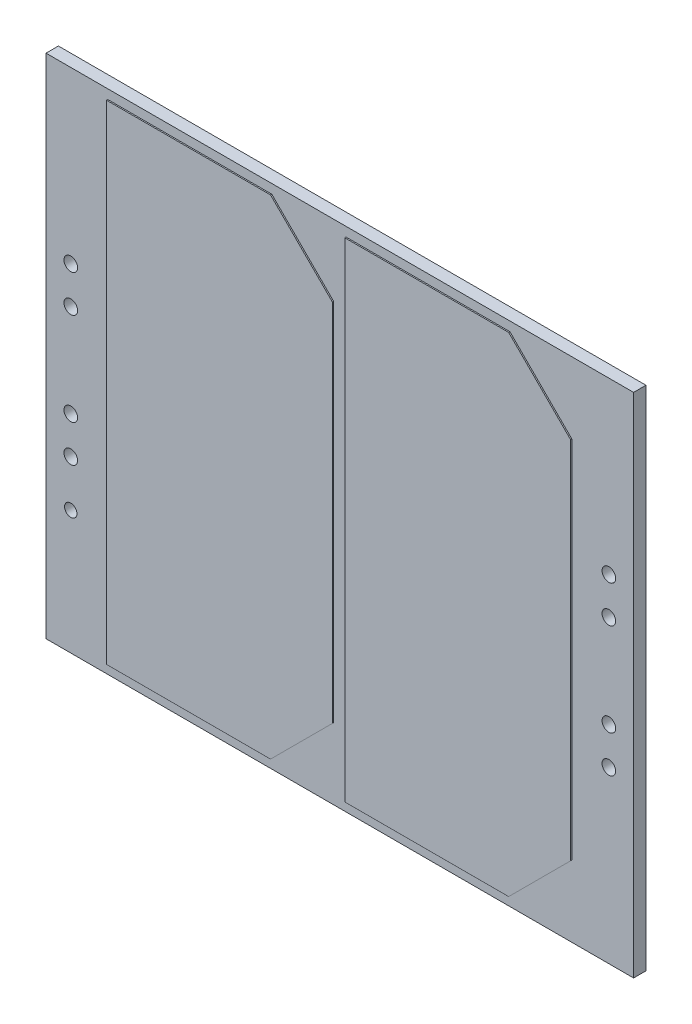
ISO-10303-21;
HEADER;
FILE_DESCRIPTION(('STEP AP214'),'2;1');
FILE_NAME('part.step','',(''),(''),'','','');
FILE_SCHEMA(('AUTOMOTIVE_DESIGN { 1 0 10303 214 1 1 1 1 }'));
ENDSEC;
DATA;
#1=APPLICATION_CONTEXT('core data for automotive mechanical design processes');
#2=APPLICATION_PROTOCOL_DEFINITION('international standard','automotive_design',2000,#1);
#3=PRODUCT_CONTEXT('',#1,'mechanical');
#4=PRODUCT('Part','Part','',(#3));
#5=PRODUCT_RELATED_PRODUCT_CATEGORY('part','',(#4));
#6=PRODUCT_DEFINITION_FORMATION('','',#4);
#7=PRODUCT_DEFINITION_CONTEXT('part definition',#1,'design');
#8=PRODUCT_DEFINITION('design','',#6,#7);
#9=PRODUCT_DEFINITION_SHAPE('','',#8);
#10=(LENGTH_UNIT() NAMED_UNIT(*) SI_UNIT(.MILLI.,.METRE.));
#11=(NAMED_UNIT(*) PLANE_ANGLE_UNIT() SI_UNIT($,.RADIAN.));
#12=(NAMED_UNIT(*) SI_UNIT($,.STERADIAN.) SOLID_ANGLE_UNIT());
#13=UNCERTAINTY_MEASURE_WITH_UNIT(LENGTH_MEASURE(1.E-05),#10,'distance_accuracy_value','');
#14=(GEOMETRIC_REPRESENTATION_CONTEXT(3) GLOBAL_UNCERTAINTY_ASSIGNED_CONTEXT((#13)) GLOBAL_UNIT_ASSIGNED_CONTEXT((#10,
#11,#12)) REPRESENTATION_CONTEXT('',''));
#15=CARTESIAN_POINT('',(0.,0.,0.));
#16=DIRECTION('',(0.,0.,1.));
#17=DIRECTION('',(1.,0.,0.));
#18=AXIS2_PLACEMENT_3D('',#15,#16,#17);
#19=CARTESIAN_POINT('',(0.,0.,2.));
#20=DIRECTION('',(0.,0.,1.));
#21=DIRECTION('',(1.,0.,0.));
#22=AXIS2_PLACEMENT_3D('',#19,#20,#21);
#23=PLANE('',#22);
#24=CARTESIAN_POINT('',(-43.5,-21.,2.));
#25=DIRECTION('',(0.,0.,1.));
#26=DIRECTION('',(1.,0.,0.));
#27=AXIS2_PLACEMENT_3D('',#24,#25,#26);
#28=CIRCLE('',#27,0.999999999999998);
#29=CARTESIAN_POINT('',(-42.5,-21.,2.));
#30=VERTEX_POINT('',#29);
#31=EDGE_CURVE('E226',#30,#30,#28,.T.);
#32=ORIENTED_EDGE('',*,*,#31,.F.);
#33=EDGE_LOOP('',(#32));
#34=FACE_BOUND('',#33,.T.);
#35=CARTESIAN_POINT('',(43.5,-13.5,2.));
#36=DIRECTION('',(0.,0.,1.));
#37=DIRECTION('',(1.,0.,0.));
#38=AXIS2_PLACEMENT_3D('',#35,#36,#37);
#39=CIRCLE('',#38,1.1);
#40=CARTESIAN_POINT('',(44.6,-13.5,2.));
#41=VERTEX_POINT('',#40);
#42=EDGE_CURVE('E229',#41,#41,#39,.T.);
#43=ORIENTED_EDGE('',*,*,#42,.F.);
#44=EDGE_LOOP('',(#43));
#45=FACE_BOUND('',#44,.T.);
#46=CARTESIAN_POINT('',(43.5,13.5,2.));
#47=DIRECTION('',(0.,0.,1.));
#48=DIRECTION('',(1.,0.,0.));
#49=AXIS2_PLACEMENT_3D('',#46,#47,#48);
#50=CIRCLE('',#49,1.1);
#51=CARTESIAN_POINT('',(44.6,13.5,2.));
#52=VERTEX_POINT('',#51);
#53=EDGE_CURVE('E233',#52,#52,#50,.T.);
#54=ORIENTED_EDGE('',*,*,#53,.F.);
#55=EDGE_LOOP('',(#54));
#56=FACE_BOUND('',#55,.T.);
#57=CARTESIAN_POINT('',(-43.5,-7.5,2.));
#58=DIRECTION('',(0.,0.,1.));
#59=DIRECTION('',(1.,0.,0.));
#60=AXIS2_PLACEMENT_3D('',#57,#58,#59);
#61=CIRCLE('',#60,1.1);
#62=CARTESIAN_POINT('',(-42.4,-7.5,2.));
#63=VERTEX_POINT('',#62);
#64=EDGE_CURVE('E236',#63,#63,#61,.T.);
#65=ORIENTED_EDGE('',*,*,#64,.F.);
#66=EDGE_LOOP('',(#65));
#67=FACE_BOUND('',#66,.T.);
#68=CARTESIAN_POINT('',(-43.5,7.5,2.));
#69=DIRECTION('',(0.,0.,1.));
#70=DIRECTION('',(1.,0.,0.));
#71=AXIS2_PLACEMENT_3D('',#68,#69,#70);
#72=CIRCLE('',#71,1.1);
#73=CARTESIAN_POINT('',(-42.4,7.5,2.));
#74=VERTEX_POINT('',#73);
#75=EDGE_CURVE('E239',#74,#74,#72,.T.);
#76=ORIENTED_EDGE('',*,*,#75,.F.);
#77=EDGE_LOOP('',(#76));
#78=FACE_BOUND('',#77,.T.);
#79=CARTESIAN_POINT('',(43.5,-7.5,2.));
#80=DIRECTION('',(0.,0.,1.));
#81=DIRECTION('',(1.,0.,0.));
#82=AXIS2_PLACEMENT_3D('',#79,#80,#81);
#83=CIRCLE('',#82,1.1);
#84=CARTESIAN_POINT('',(44.6,-7.5,2.));
#85=VERTEX_POINT('',#84);
#86=EDGE_CURVE('E242',#85,#85,#83,.T.);
#87=ORIENTED_EDGE('',*,*,#86,.F.);
#88=EDGE_LOOP('',(#87));
#89=FACE_BOUND('',#88,.T.);
#90=CARTESIAN_POINT('',(43.5,7.5,2.));
#91=DIRECTION('',(0.,0.,1.));
#92=DIRECTION('',(1.,0.,0.));
#93=AXIS2_PLACEMENT_3D('',#90,#91,#92);
#94=CIRCLE('',#93,1.1);
#95=CARTESIAN_POINT('',(44.6,7.5,2.));
#96=VERTEX_POINT('',#95);
#97=EDGE_CURVE('E245',#96,#96,#94,.T.);
#98=ORIENTED_EDGE('',*,*,#97,.F.);
#99=EDGE_LOOP('',(#98));
#100=FACE_BOUND('',#99,.T.);
#101=CARTESIAN_POINT('',(-43.5,-13.5,2.));
#102=DIRECTION('',(0.,0.,1.));
#103=DIRECTION('',(1.,0.,0.));
#104=AXIS2_PLACEMENT_3D('',#101,#102,#103);
#105=CIRCLE('',#104,1.1);
#106=CARTESIAN_POINT('',(-42.4,-13.5,2.));
#107=VERTEX_POINT('',#106);
#108=EDGE_CURVE('E248',#107,#107,#105,.T.);
#109=ORIENTED_EDGE('',*,*,#108,.F.);
#110=EDGE_LOOP('',(#109));
#111=FACE_BOUND('',#110,.T.);
#112=CARTESIAN_POINT('',(-43.5,13.5,2.));
#113=DIRECTION('',(0.,0.,1.));
#114=DIRECTION('',(1.,0.,0.));
#115=AXIS2_PLACEMENT_3D('',#112,#113,#114);
#116=CIRCLE('',#115,1.1);
#117=CARTESIAN_POINT('',(-42.4,13.5,2.));
#118=VERTEX_POINT('',#117);
#119=EDGE_CURVE('E251',#118,#118,#116,.T.);
#120=ORIENTED_EDGE('',*,*,#119,.F.);
#121=EDGE_LOOP('',(#120));
#122=FACE_BOUND('',#121,.T.);
#123=DIRECTION('',(1.,0.,0.));
#124=VECTOR('',#123,1.);
#125=CARTESIAN_POINT('',(0.,-41.,2.));
#126=LINE('',#125,#124);
#127=CARTESIAN_POINT('',(-47.5,-41.,2.));
#128=VERTEX_POINT('',#127);
#129=CARTESIAN_POINT('',(47.5,-41.,2.));
#130=VERTEX_POINT('',#129);
#131=EDGE_CURVE('E254',#128,#130,#126,.T.);
#132=ORIENTED_EDGE('',*,*,#131,.T.);
#133=DIRECTION('',(0.,1.,0.));
#134=VECTOR('',#133,1.);
#135=CARTESIAN_POINT('',(47.5,0.,2.));
#136=LINE('',#135,#134);
#137=CARTESIAN_POINT('',(47.5,41.,2.));
#138=VERTEX_POINT('',#137);
#139=EDGE_CURVE('E257',#130,#138,#136,.T.);
#140=ORIENTED_EDGE('',*,*,#139,.T.);
#141=DIRECTION('',(1.,0.,0.));
#142=VECTOR('',#141,1.);
#143=CARTESIAN_POINT('',(0.,41.,2.));
#144=LINE('',#143,#142);
#145=CARTESIAN_POINT('',(-47.5,41.,2.));
#146=VERTEX_POINT('',#145);
#147=EDGE_CURVE('E259',#146,#138,#144,.T.);
#148=ORIENTED_EDGE('',*,*,#147,.F.);
#149=DIRECTION('',(0.,1.,0.));
#150=VECTOR('',#149,1.);
#151=CARTESIAN_POINT('',(-47.5,0.,2.));
#152=LINE('',#151,#150);
#153=EDGE_CURVE('E262',#128,#146,#152,.T.);
#154=ORIENTED_EDGE('',*,*,#153,.F.);
#155=EDGE_LOOP('',(#132,#140,#148,#154));
#156=FACE_BOUND('',#155,.T.);
#157=DIRECTION('',(1.,0.,0.));
#158=VECTOR('',#157,1.);
#159=CARTESIAN_POINT('',(-37.5,-39.5,2.));
#160=LINE('',#159,#158);
#161=CARTESIAN_POINT('',(-37.5,-39.5,2.));
#162=VERTEX_POINT('',#161);
#163=CARTESIAN_POINT('',(-11.,-39.5,2.));
#164=VERTEX_POINT('',#163);
#165=EDGE_CURVE('E182',#162,#164,#160,.T.);
#166=ORIENTED_EDGE('',*,*,#165,.F.);
#167=DIRECTION('',(0.,-1.,0.));
#168=VECTOR('',#167,1.);
#169=CARTESIAN_POINT('',(-37.5,39.5,2.));
#170=LINE('',#169,#168);
#171=CARTESIAN_POINT('',(-37.5,39.5,2.));
#172=VERTEX_POINT('',#171);
#173=EDGE_CURVE('E179',#172,#162,#170,.T.);
#174=ORIENTED_EDGE('',*,*,#173,.F.);
#175=DIRECTION('',(-1.,0.,0.));
#176=VECTOR('',#175,1.);
#177=CARTESIAN_POINT('',(-37.5,39.5,2.));
#178=LINE('',#177,#176);
#179=CARTESIAN_POINT('',(-11.,39.5,2.));
#180=VERTEX_POINT('',#179);
#181=EDGE_CURVE('E192',#180,#172,#178,.T.);
#182=ORIENTED_EDGE('',*,*,#181,.F.);
#183=DIRECTION('',(-0.707106781186548,0.707106781186547,0.));
#184=VECTOR('',#183,1.);
#185=CARTESIAN_POINT('',(-11.,39.5,2.));
#186=LINE('',#185,#184);
#187=CARTESIAN_POINT('',(-1.00000000000004,29.5,2.));
#188=VERTEX_POINT('',#187);
#189=EDGE_CURVE('E208',#188,#180,#186,.T.);
#190=ORIENTED_EDGE('',*,*,#189,.F.);
#191=DIRECTION('',(0.,1.,0.));
#192=VECTOR('',#191,1.);
#193=CARTESIAN_POINT('',(-1.00000000000004,29.5,2.));
#194=LINE('',#193,#192);
#195=CARTESIAN_POINT('',(-1.00000000000004,-29.5,2.));
#196=VERTEX_POINT('',#195);
#197=EDGE_CURVE('E206',#196,#188,#194,.T.);
#198=ORIENTED_EDGE('',*,*,#197,.F.);
#199=DIRECTION('',(0.707106781186547,0.707106781186548,0.));
#200=VECTOR('',#199,1.);
#201=CARTESIAN_POINT('',(-1.00000000000004,-29.5,2.));
#202=LINE('',#201,#200);
#203=EDGE_CURVE('E204',#164,#196,#202,.T.);
#204=ORIENTED_EDGE('',*,*,#203,.F.);
#205=EDGE_LOOP('',(#166,#174,#182,#190,#198,#204));
#206=FACE_BOUND('',#205,.T.);
#207=DIRECTION('',(1.,0.,0.));
#208=VECTOR('',#207,1.);
#209=CARTESIAN_POINT('',(0.999999999999959,-39.5,2.));
#210=LINE('',#209,#208);
#211=CARTESIAN_POINT('',(0.999999999999959,-39.5,2.));
#212=VERTEX_POINT('',#211);
#213=CARTESIAN_POINT('',(27.5,-39.5,2.));
#214=VERTEX_POINT('',#213);
#215=EDGE_CURVE('E605',#212,#214,#210,.T.);
#216=ORIENTED_EDGE('',*,*,#215,.F.);
#217=DIRECTION('',(0.,-1.,0.));
#218=VECTOR('',#217,1.);
#219=CARTESIAN_POINT('',(0.999999999999956,39.5,2.));
#220=LINE('',#219,#218);
#221=CARTESIAN_POINT('',(0.999999999999956,39.5,2.));
#222=VERTEX_POINT('',#221);
#223=EDGE_CURVE('E177',#222,#212,#220,.T.);
#224=ORIENTED_EDGE('',*,*,#223,.F.);
#225=DIRECTION('',(-1.,0.,0.));
#226=VECTOR('',#225,1.);
#227=CARTESIAN_POINT('',(0.999999999999956,39.5,2.));
#228=LINE('',#227,#226);
#229=CARTESIAN_POINT('',(27.5,39.5,2.));
#230=VERTEX_POINT('',#229);
#231=EDGE_CURVE('E173',#230,#222,#228,.T.);
#232=ORIENTED_EDGE('',*,*,#231,.F.);
#233=DIRECTION('',(-0.707106781186547,0.707106781186548,0.));
#234=VECTOR('',#233,1.);
#235=CARTESIAN_POINT('',(27.5,39.5,2.));
#236=LINE('',#235,#234);
#237=CARTESIAN_POINT('',(37.5,29.5,2.));
#238=VERTEX_POINT('',#237);
#239=EDGE_CURVE('E601',#238,#230,#236,.T.);
#240=ORIENTED_EDGE('',*,*,#239,.F.);
#241=DIRECTION('',(0.,1.,0.));
#242=VECTOR('',#241,1.);
#243=CARTESIAN_POINT('',(37.5,29.5,2.));
#244=LINE('',#243,#242);
#245=CARTESIAN_POINT('',(37.5,-29.5,2.));
#246=VERTEX_POINT('',#245);
#247=EDGE_CURVE('E613',#246,#238,#244,.T.);
#248=ORIENTED_EDGE('',*,*,#247,.F.);
#249=DIRECTION('',(0.707106781186547,0.707106781186548,0.));
#250=VECTOR('',#249,1.);
#251=CARTESIAN_POINT('',(27.5,-39.5,2.));
#252=LINE('',#251,#250);
#253=EDGE_CURVE('E607',#214,#246,#252,.T.);
#254=ORIENTED_EDGE('',*,*,#253,.F.);
#255=EDGE_LOOP('',(#216,#224,#232,#240,#248,#254));
#256=FACE_BOUND('',#255,.T.);
#257=ADVANCED_FACE('F40',(#34,#45,#56,#67,#78,#89,#100,#111,#122,#156,#206,#256),#23,.T.);
#258=CARTESIAN_POINT('',(0.,-41.,2.));
#259=DIRECTION('',(0.,1.,0.));
#260=DIRECTION('',(0.,0.,1.));
#261=AXIS2_PLACEMENT_3D('',#258,#259,#260);
#262=PLANE('',#261);
#263=DIRECTION('',(1.,0.,0.));
#264=VECTOR('',#263,1.);
#265=CARTESIAN_POINT('',(0.,-41.,0.));
#266=LINE('',#265,#264);
#267=CARTESIAN_POINT('',(-47.5,-41.,0.));
#268=VERTEX_POINT('',#267);
#269=CARTESIAN_POINT('',(47.5,-41.,0.));
#270=VERTEX_POINT('',#269);
#271=EDGE_CURVE('E292',#268,#270,#266,.T.);
#272=ORIENTED_EDGE('',*,*,#271,.T.);
#273=DIRECTION('',(0.,0.,-1.));
#274=VECTOR('',#273,1.);
#275=CARTESIAN_POINT('',(47.5,-41.,2.));
#276=LINE('',#275,#274);
#277=EDGE_CURVE('E11',#130,#270,#276,.T.);
#278=ORIENTED_EDGE('',*,*,#277,.F.);
#279=ORIENTED_EDGE('',*,*,#131,.F.);
#280=DIRECTION('',(0.,0.,-1.));
#281=VECTOR('',#280,1.);
#282=CARTESIAN_POINT('',(-47.5,-41.,2.));
#283=LINE('',#282,#281);
#284=EDGE_CURVE('E265',#128,#268,#283,.T.);
#285=ORIENTED_EDGE('',*,*,#284,.T.);
#286=EDGE_LOOP('',(#272,#278,#279,#285));
#287=FACE_BOUND('',#286,.T.);
#288=ADVANCED_FACE('F324',(#287),#262,.F.);
#289=CARTESIAN_POINT('',(47.5,0.,2.));
#290=DIRECTION('',(-1.,0.,0.));
#291=DIRECTION('',(0.,0.,1.));
#292=AXIS2_PLACEMENT_3D('',#289,#290,#291);
#293=PLANE('',#292);
#294=DIRECTION('',(0.,1.,0.));
#295=VECTOR('',#294,1.);
#296=CARTESIAN_POINT('',(47.5,0.,0.));
#297=LINE('',#296,#295);
#298=CARTESIAN_POINT('',(47.5,41.,0.));
#299=VERTEX_POINT('',#298);
#300=EDGE_CURVE('E295',#270,#299,#297,.T.);
#301=ORIENTED_EDGE('',*,*,#300,.T.);
#302=DIRECTION('',(0.,0.,-1.));
#303=VECTOR('',#302,1.);
#304=CARTESIAN_POINT('',(47.5,41.,2.));
#305=LINE('',#304,#303);
#306=EDGE_CURVE('E48',#138,#299,#305,.T.);
#307=ORIENTED_EDGE('',*,*,#306,.F.);
#308=ORIENTED_EDGE('',*,*,#139,.F.);
#309=ORIENTED_EDGE('',*,*,#277,.T.);
#310=EDGE_LOOP('',(#301,#307,#308,#309));
#311=FACE_BOUND('',#310,.T.);
#312=ADVANCED_FACE('F311',(#311),#293,.F.);
#313=CARTESIAN_POINT('',(0.,41.,2.));
#314=DIRECTION('',(0.,1.,0.));
#315=DIRECTION('',(0.,0.,1.));
#316=AXIS2_PLACEMENT_3D('',#313,#314,#315);
#317=PLANE('',#316);
#318=DIRECTION('',(1.,0.,0.));
#319=VECTOR('',#318,1.);
#320=CARTESIAN_POINT('',(0.,41.,0.));
#321=LINE('',#320,#319);
#322=CARTESIAN_POINT('',(-47.5,41.,0.));
#323=VERTEX_POINT('',#322);
#324=EDGE_CURVE('E298',#323,#299,#321,.T.);
#325=ORIENTED_EDGE('',*,*,#324,.F.);
#326=DIRECTION('',(0.,0.,-1.));
#327=VECTOR('',#326,1.);
#328=CARTESIAN_POINT('',(-47.5,41.,2.));
#329=LINE('',#328,#327);
#330=EDGE_CURVE('E304',#146,#323,#329,.T.);
#331=ORIENTED_EDGE('',*,*,#330,.F.);
#332=ORIENTED_EDGE('',*,*,#147,.T.);
#333=ORIENTED_EDGE('',*,*,#306,.T.);
#334=EDGE_LOOP('',(#325,#331,#332,#333));
#335=FACE_BOUND('',#334,.T.);
#336=ADVANCED_FACE('F308',(#335),#317,.T.);
#337=CARTESIAN_POINT('',(-43.5,13.5,2.));
#338=DIRECTION('',(0.,0.,-1.));
#339=DIRECTION('',(-1.,0.,0.));
#340=AXIS2_PLACEMENT_3D('',#337,#338,#339);
#341=CYLINDRICAL_SURFACE('',#340,1.1);
#342=ORIENTED_EDGE('',*,*,#119,.T.);
#343=EDGE_LOOP('',(#342));
#344=FACE_BOUND('',#343,.T.);
#345=CARTESIAN_POINT('',(-43.5,13.5,0.));
#346=DIRECTION('',(0.,0.,1.));
#347=DIRECTION('',(1.,0.,0.));
#348=AXIS2_PLACEMENT_3D('',#345,#346,#347);
#349=CIRCLE('',#348,1.1);
#350=CARTESIAN_POINT('',(-42.4,13.5,0.));
#351=VERTEX_POINT('',#350);
#352=EDGE_CURVE('E289',#351,#351,#349,.T.);
#353=ORIENTED_EDGE('',*,*,#352,.F.);
#354=EDGE_LOOP('',(#353));
#355=FACE_BOUND('',#354,.T.);
#356=ADVANCED_FACE('F336',(#344,#355),#341,.F.);
#357=CARTESIAN_POINT('',(-43.5,-13.5,2.));
#358=DIRECTION('',(0.,0.,-1.));
#359=DIRECTION('',(-1.,0.,0.));
#360=AXIS2_PLACEMENT_3D('',#357,#358,#359);
#361=CYLINDRICAL_SURFACE('',#360,1.1);
#362=ORIENTED_EDGE('',*,*,#108,.T.);
#363=EDGE_LOOP('',(#362));
#364=FACE_BOUND('',#363,.T.);
#365=CARTESIAN_POINT('',(-43.5,-13.5,0.));
#366=DIRECTION('',(0.,0.,1.));
#367=DIRECTION('',(1.,0.,0.));
#368=AXIS2_PLACEMENT_3D('',#365,#366,#367);
#369=CIRCLE('',#368,1.1);
#370=CARTESIAN_POINT('',(-42.4,-13.5,0.));
#371=VERTEX_POINT('',#370);
#372=EDGE_CURVE('E286',#371,#371,#369,.T.);
#373=ORIENTED_EDGE('',*,*,#372,.F.);
#374=EDGE_LOOP('',(#373));
#375=FACE_BOUND('',#374,.T.);
#376=ADVANCED_FACE('F339',(#364,#375),#361,.F.);
#377=CARTESIAN_POINT('',(43.5,7.5,2.));
#378=DIRECTION('',(0.,0.,-1.));
#379=DIRECTION('',(-1.,0.,0.));
#380=AXIS2_PLACEMENT_3D('',#377,#378,#379);
#381=CYLINDRICAL_SURFACE('',#380,1.1);
#382=ORIENTED_EDGE('',*,*,#97,.T.);
#383=EDGE_LOOP('',(#382));
#384=FACE_BOUND('',#383,.T.);
#385=CARTESIAN_POINT('',(43.5,7.5,0.));
#386=DIRECTION('',(0.,0.,1.));
#387=DIRECTION('',(1.,0.,0.));
#388=AXIS2_PLACEMENT_3D('',#385,#386,#387);
#389=CIRCLE('',#388,1.1);
#390=CARTESIAN_POINT('',(44.6,7.5,0.));
#391=VERTEX_POINT('',#390);
#392=EDGE_CURVE('E283',#391,#391,#389,.T.);
#393=ORIENTED_EDGE('',*,*,#392,.F.);
#394=EDGE_LOOP('',(#393));
#395=FACE_BOUND('',#394,.T.);
#396=ADVANCED_FACE('F343',(#384,#395),#381,.F.);
#397=CARTESIAN_POINT('',(43.5,-7.5,2.));
#398=DIRECTION('',(0.,0.,-1.));
#399=DIRECTION('',(-1.,0.,0.));
#400=AXIS2_PLACEMENT_3D('',#397,#398,#399);
#401=CYLINDRICAL_SURFACE('',#400,1.1);
#402=ORIENTED_EDGE('',*,*,#86,.T.);
#403=EDGE_LOOP('',(#402));
#404=FACE_BOUND('',#403,.T.);
#405=CARTESIAN_POINT('',(43.5,-7.5,0.));
#406=DIRECTION('',(0.,0.,1.));
#407=DIRECTION('',(1.,0.,0.));
#408=AXIS2_PLACEMENT_3D('',#405,#406,#407);
#409=CIRCLE('',#408,1.1);
#410=CARTESIAN_POINT('',(44.6,-7.5,0.));
#411=VERTEX_POINT('',#410);
#412=EDGE_CURVE('E280',#411,#411,#409,.T.);
#413=ORIENTED_EDGE('',*,*,#412,.F.);
#414=EDGE_LOOP('',(#413));
#415=FACE_BOUND('',#414,.T.);
#416=ADVANCED_FACE('F347',(#404,#415),#401,.F.);
#417=CARTESIAN_POINT('',(-43.5,7.5,2.));
#418=DIRECTION('',(0.,0.,-1.));
#419=DIRECTION('',(-1.,0.,0.));
#420=AXIS2_PLACEMENT_3D('',#417,#418,#419);
#421=CYLINDRICAL_SURFACE('',#420,1.1);
#422=ORIENTED_EDGE('',*,*,#75,.T.);
#423=EDGE_LOOP('',(#422));
#424=FACE_BOUND('',#423,.T.);
#425=CARTESIAN_POINT('',(-43.5,7.5,0.));
#426=DIRECTION('',(0.,0.,1.));
#427=DIRECTION('',(1.,0.,0.));
#428=AXIS2_PLACEMENT_3D('',#425,#426,#427);
#429=CIRCLE('',#428,1.1);
#430=CARTESIAN_POINT('',(-42.4,7.5,0.));
#431=VERTEX_POINT('',#430);
#432=EDGE_CURVE('E277',#431,#431,#429,.T.);
#433=ORIENTED_EDGE('',*,*,#432,.F.);
#434=EDGE_LOOP('',(#433));
#435=FACE_BOUND('',#434,.T.);
#436=ADVANCED_FACE('F351',(#424,#435),#421,.F.);
#437=CARTESIAN_POINT('',(-43.5,-7.5,2.));
#438=DIRECTION('',(0.,0.,-1.));
#439=DIRECTION('',(-1.,0.,0.));
#440=AXIS2_PLACEMENT_3D('',#437,#438,#439);
#441=CYLINDRICAL_SURFACE('',#440,1.1);
#442=ORIENTED_EDGE('',*,*,#64,.T.);
#443=EDGE_LOOP('',(#442));
#444=FACE_BOUND('',#443,.T.);
#445=CARTESIAN_POINT('',(-43.5,-7.5,0.));
#446=DIRECTION('',(0.,0.,1.));
#447=DIRECTION('',(1.,0.,0.));
#448=AXIS2_PLACEMENT_3D('',#445,#446,#447);
#449=CIRCLE('',#448,1.1);
#450=CARTESIAN_POINT('',(-42.4,-7.5,0.));
#451=VERTEX_POINT('',#450);
#452=EDGE_CURVE('E274',#451,#451,#449,.T.);
#453=ORIENTED_EDGE('',*,*,#452,.F.);
#454=EDGE_LOOP('',(#453));
#455=FACE_BOUND('',#454,.T.);
#456=ADVANCED_FACE('F355',(#444,#455),#441,.F.);
#457=CARTESIAN_POINT('',(43.5,13.5,2.));
#458=DIRECTION('',(0.,0.,-1.));
#459=DIRECTION('',(-1.,0.,0.));
#460=AXIS2_PLACEMENT_3D('',#457,#458,#459);
#461=CYLINDRICAL_SURFACE('',#460,1.1);
#462=ORIENTED_EDGE('',*,*,#53,.T.);
#463=EDGE_LOOP('',(#462));
#464=FACE_BOUND('',#463,.T.);
#465=CARTESIAN_POINT('',(43.5,13.5,0.));
#466=DIRECTION('',(0.,0.,1.));
#467=DIRECTION('',(1.,0.,0.));
#468=AXIS2_PLACEMENT_3D('',#465,#466,#467);
#469=CIRCLE('',#468,1.1);
#470=CARTESIAN_POINT('',(44.6,13.5,0.));
#471=VERTEX_POINT('',#470);
#472=EDGE_CURVE('E271',#471,#471,#469,.T.);
#473=ORIENTED_EDGE('',*,*,#472,.F.);
#474=EDGE_LOOP('',(#473));
#475=FACE_BOUND('',#474,.T.);
#476=ADVANCED_FACE('F359',(#464,#475),#461,.F.);
#477=CARTESIAN_POINT('',(43.5,-13.5,2.));
#478=DIRECTION('',(0.,0.,-1.));
#479=DIRECTION('',(-1.,0.,0.));
#480=AXIS2_PLACEMENT_3D('',#477,#478,#479);
#481=CYLINDRICAL_SURFACE('',#480,1.1);
#482=ORIENTED_EDGE('',*,*,#42,.T.);
#483=EDGE_LOOP('',(#482));
#484=FACE_BOUND('',#483,.T.);
#485=CARTESIAN_POINT('',(43.5,-13.5,0.));
#486=DIRECTION('',(0.,0.,1.));
#487=DIRECTION('',(1.,0.,0.));
#488=AXIS2_PLACEMENT_3D('',#485,#486,#487);
#489=CIRCLE('',#488,1.1);
#490=CARTESIAN_POINT('',(44.6,-13.5,0.));
#491=VERTEX_POINT('',#490);
#492=EDGE_CURVE('E268',#491,#491,#489,.T.);
#493=ORIENTED_EDGE('',*,*,#492,.F.);
#494=EDGE_LOOP('',(#493));
#495=FACE_BOUND('',#494,.T.);
#496=ADVANCED_FACE('F362',(#484,#495),#481,.F.);
#497=CARTESIAN_POINT('',(-43.5,-21.,2.));
#498=DIRECTION('',(0.,0.,-1.));
#499=DIRECTION('',(-1.,0.,0.));
#500=AXIS2_PLACEMENT_3D('',#497,#498,#499);
#501=CYLINDRICAL_SURFACE('',#500,0.999999999999998);
#502=ORIENTED_EDGE('',*,*,#31,.T.);
#503=EDGE_LOOP('',(#502));
#504=FACE_BOUND('',#503,.T.);
#505=CARTESIAN_POINT('',(-43.5,-21.,0.));
#506=DIRECTION('',(0.,0.,1.));
#507=DIRECTION('',(1.,0.,0.));
#508=AXIS2_PLACEMENT_3D('',#505,#506,#507);
#509=CIRCLE('',#508,0.999999999999998);
#510=CARTESIAN_POINT('',(-42.5,-21.,0.));
#511=VERTEX_POINT('',#510);
#512=EDGE_CURVE('E225',#511,#511,#509,.T.);
#513=ORIENTED_EDGE('',*,*,#512,.F.);
#514=EDGE_LOOP('',(#513));
#515=FACE_BOUND('',#514,.T.);
#516=ADVANCED_FACE('F42',(#504,#515),#501,.F.);
#517=CARTESIAN_POINT('',(-47.5,0.,2.));
#518=DIRECTION('',(-1.,0.,0.));
#519=DIRECTION('',(0.,0.,1.));
#520=AXIS2_PLACEMENT_3D('',#517,#518,#519);
#521=PLANE('',#520);
#522=DIRECTION('',(0.,1.,0.));
#523=VECTOR('',#522,1.);
#524=CARTESIAN_POINT('',(-47.5,0.,0.));
#525=LINE('',#524,#523);
#526=EDGE_CURVE('E230',#268,#323,#525,.T.);
#527=ORIENTED_EDGE('',*,*,#526,.F.);
#528=ORIENTED_EDGE('',*,*,#284,.F.);
#529=ORIENTED_EDGE('',*,*,#153,.T.);
#530=ORIENTED_EDGE('',*,*,#330,.T.);
#531=EDGE_LOOP('',(#527,#528,#529,#530));
#532=FACE_BOUND('',#531,.T.);
#533=ADVANCED_FACE('F318',(#532),#521,.T.);
#534=CARTESIAN_POINT('',(0.,0.,0.));
#535=DIRECTION('',(0.,0.,1.));
#536=DIRECTION('',(1.,0.,0.));
#537=AXIS2_PLACEMENT_3D('',#534,#535,#536);
#538=PLANE('',#537);
#539=ORIENTED_EDGE('',*,*,#512,.T.);
#540=EDGE_LOOP('',(#539));
#541=FACE_BOUND('',#540,.T.);
#542=ORIENTED_EDGE('',*,*,#492,.T.);
#543=EDGE_LOOP('',(#542));
#544=FACE_BOUND('',#543,.T.);
#545=ORIENTED_EDGE('',*,*,#472,.T.);
#546=EDGE_LOOP('',(#545));
#547=FACE_BOUND('',#546,.T.);
#548=ORIENTED_EDGE('',*,*,#452,.T.);
#549=EDGE_LOOP('',(#548));
#550=FACE_BOUND('',#549,.T.);
#551=ORIENTED_EDGE('',*,*,#432,.T.);
#552=EDGE_LOOP('',(#551));
#553=FACE_BOUND('',#552,.T.);
#554=ORIENTED_EDGE('',*,*,#412,.T.);
#555=EDGE_LOOP('',(#554));
#556=FACE_BOUND('',#555,.T.);
#557=ORIENTED_EDGE('',*,*,#392,.T.);
#558=EDGE_LOOP('',(#557));
#559=FACE_BOUND('',#558,.T.);
#560=ORIENTED_EDGE('',*,*,#372,.T.);
#561=EDGE_LOOP('',(#560));
#562=FACE_BOUND('',#561,.T.);
#563=ORIENTED_EDGE('',*,*,#352,.T.);
#564=EDGE_LOOP('',(#563));
#565=FACE_BOUND('',#564,.T.);
#566=ORIENTED_EDGE('',*,*,#271,.F.);
#567=ORIENTED_EDGE('',*,*,#526,.T.);
#568=ORIENTED_EDGE('',*,*,#324,.T.);
#569=ORIENTED_EDGE('',*,*,#300,.F.);
#570=EDGE_LOOP('',(#566,#567,#568,#569));
#571=FACE_BOUND('',#570,.T.);
#572=ADVANCED_FACE('F315',(#541,#544,#547,#550,#553,#556,#559,#562,#565,#571),#538,.F.);
#573=CARTESIAN_POINT('',(-37.5,39.5,2.2));
#574=DIRECTION('',(1.,0.,0.));
#575=DIRECTION('',(0.,0.,-1.));
#576=AXIS2_PLACEMENT_3D('',#573,#574,#575);
#577=PLANE('',#576);
#578=ORIENTED_EDGE('',*,*,#173,.T.);
#579=DIRECTION('',(0.,0.,-1.));
#580=VECTOR('',#579,1.);
#581=CARTESIAN_POINT('',(-37.5,-39.5,2.2));
#582=LINE('',#581,#580);
#583=CARTESIAN_POINT('',(-37.5,-39.5,2.2));
#584=VERTEX_POINT('',#583);
#585=EDGE_CURVE('E223',#584,#162,#582,.T.);
#586=ORIENTED_EDGE('',*,*,#585,.F.);
#587=DIRECTION('',(0.,-1.,0.));
#588=VECTOR('',#587,1.);
#589=CARTESIAN_POINT('',(-37.5,39.5,2.2));
#590=LINE('',#589,#588);
#591=CARTESIAN_POINT('',(-37.5,39.5,2.2));
#592=VERTEX_POINT('',#591);
#593=EDGE_CURVE('E188',#592,#584,#590,.T.);
#594=ORIENTED_EDGE('',*,*,#593,.F.);
#595=DIRECTION('',(0.,0.,-1.));
#596=VECTOR('',#595,1.);
#597=CARTESIAN_POINT('',(-37.5,39.5,2.2));
#598=LINE('',#597,#596);
#599=EDGE_CURVE('E201',#592,#172,#598,.T.);
#600=ORIENTED_EDGE('',*,*,#599,.T.);
#601=EDGE_LOOP('',(#578,#586,#594,#600));
#602=FACE_BOUND('',#601,.T.);
#603=ADVANCED_FACE('F376',(#602),#577,.F.);
#604=CARTESIAN_POINT('',(-37.5,-39.5,2.2));
#605=DIRECTION('',(0.,1.,0.));
#606=DIRECTION('',(0.,0.,1.));
#607=AXIS2_PLACEMENT_3D('',#604,#605,#606);
#608=PLANE('',#607);
#609=ORIENTED_EDGE('',*,*,#165,.T.);
#610=DIRECTION('',(0.,0.,-1.));
#611=VECTOR('',#610,1.);
#612=CARTESIAN_POINT('',(-11.,-39.5,2.2));
#613=LINE('',#612,#611);
#614=CARTESIAN_POINT('',(-11.,-39.5,2.2));
#615=VERTEX_POINT('',#614);
#616=EDGE_CURVE('E220',#615,#164,#613,.T.);
#617=ORIENTED_EDGE('',*,*,#616,.F.);
#618=DIRECTION('',(1.,0.,0.));
#619=VECTOR('',#618,1.);
#620=CARTESIAN_POINT('',(-37.5,-39.5,2.2));
#621=LINE('',#620,#619);
#622=EDGE_CURVE('E191',#584,#615,#621,.T.);
#623=ORIENTED_EDGE('',*,*,#622,.F.);
#624=ORIENTED_EDGE('',*,*,#585,.T.);
#625=EDGE_LOOP('',(#609,#617,#623,#624));
#626=FACE_BOUND('',#625,.T.);
#627=ADVANCED_FACE('F403',(#626),#608,.F.);
#628=CARTESIAN_POINT('',(-1.00000000000004,-29.5,2.2));
#629=DIRECTION('',(-0.707106781186548,0.707106781186548,0.));
#630=DIRECTION('',(-0.707106781186547,-0.707106781186548,0.));
#631=AXIS2_PLACEMENT_3D('',#628,#629,#630);
#632=PLANE('',#631);
#633=ORIENTED_EDGE('',*,*,#203,.T.);
#634=DIRECTION('',(0.,0.,-1.));
#635=VECTOR('',#634,1.);
#636=CARTESIAN_POINT('',(-1.00000000000004,-29.5,2.2));
#637=LINE('',#636,#635);
#638=CARTESIAN_POINT('',(-1.00000000000004,-29.5,2.2));
#639=VERTEX_POINT('',#638);
#640=EDGE_CURVE('E217',#639,#196,#637,.T.);
#641=ORIENTED_EDGE('',*,*,#640,.F.);
#642=DIRECTION('',(0.707106781186547,0.707106781186548,0.));
#643=VECTOR('',#642,1.);
#644=CARTESIAN_POINT('',(-1.00000000000004,-29.5,2.2));
#645=LINE('',#644,#643);
#646=EDGE_CURVE('E194',#615,#639,#645,.T.);
#647=ORIENTED_EDGE('',*,*,#646,.F.);
#648=ORIENTED_EDGE('',*,*,#616,.T.);
#649=EDGE_LOOP('',(#633,#641,#647,#648));
#650=FACE_BOUND('',#649,.T.);
#651=ADVANCED_FACE('F481',(#650),#632,.F.);
#652=CARTESIAN_POINT('',(-1.00000000000004,29.5,2.2));
#653=DIRECTION('',(-1.,0.,0.));
#654=DIRECTION('',(0.,0.,1.));
#655=AXIS2_PLACEMENT_3D('',#652,#653,#654);
#656=PLANE('',#655);
#657=ORIENTED_EDGE('',*,*,#197,.T.);
#658=DIRECTION('',(0.,0.,-1.));
#659=VECTOR('',#658,1.);
#660=CARTESIAN_POINT('',(-1.00000000000004,29.5,2.2));
#661=LINE('',#660,#659);
#662=CARTESIAN_POINT('',(-1.00000000000004,29.5,2.2));
#663=VERTEX_POINT('',#662);
#664=EDGE_CURVE('E214',#663,#188,#661,.T.);
#665=ORIENTED_EDGE('',*,*,#664,.F.);
#666=DIRECTION('',(0.,1.,0.));
#667=VECTOR('',#666,1.);
#668=CARTESIAN_POINT('',(-1.00000000000004,29.5,2.2));
#669=LINE('',#668,#667);
#670=EDGE_CURVE('E196',#639,#663,#669,.T.);
#671=ORIENTED_EDGE('',*,*,#670,.F.);
#672=ORIENTED_EDGE('',*,*,#640,.T.);
#673=EDGE_LOOP('',(#657,#665,#671,#672));
#674=FACE_BOUND('',#673,.T.);
#675=ADVANCED_FACE('F491',(#674),#656,.F.);
#676=CARTESIAN_POINT('',(-11.,39.5,2.2));
#677=DIRECTION('',(-0.707106781186547,-0.707106781186548,0.));
#678=DIRECTION('',(0.707106781186548,-0.707106781186547,0.));
#679=AXIS2_PLACEMENT_3D('',#676,#677,#678);
#680=PLANE('',#679);
#681=ORIENTED_EDGE('',*,*,#189,.T.);
#682=DIRECTION('',(0.,0.,-1.));
#683=VECTOR('',#682,1.);
#684=CARTESIAN_POINT('',(-11.,39.5,2.2));
#685=LINE('',#684,#683);
#686=CARTESIAN_POINT('',(-11.,39.5,2.2));
#687=VERTEX_POINT('',#686);
#688=EDGE_CURVE('E63',#687,#180,#685,.T.);
#689=ORIENTED_EDGE('',*,*,#688,.F.);
#690=DIRECTION('',(-0.707106781186548,0.707106781186547,0.));
#691=VECTOR('',#690,1.);
#692=CARTESIAN_POINT('',(-11.,39.5,2.2));
#693=LINE('',#692,#691);
#694=EDGE_CURVE('E198',#663,#687,#693,.T.);
#695=ORIENTED_EDGE('',*,*,#694,.F.);
#696=ORIENTED_EDGE('',*,*,#664,.T.);
#697=EDGE_LOOP('',(#681,#689,#695,#696));
#698=FACE_BOUND('',#697,.T.);
#699=ADVANCED_FACE('F501',(#698),#680,.F.);
#700=CARTESIAN_POINT('',(-37.5,39.5,2.2));
#701=DIRECTION('',(0.,-1.,0.));
#702=DIRECTION('',(1.,0.,0.));
#703=AXIS2_PLACEMENT_3D('',#700,#701,#702);
#704=PLANE('',#703);
#705=ORIENTED_EDGE('',*,*,#181,.T.);
#706=ORIENTED_EDGE('',*,*,#599,.F.);
#707=DIRECTION('',(-1.,0.,0.));
#708=VECTOR('',#707,1.);
#709=CARTESIAN_POINT('',(-37.5,39.5,2.2));
#710=LINE('',#709,#708);
#711=EDGE_CURVE('E200',#687,#592,#710,.T.);
#712=ORIENTED_EDGE('',*,*,#711,.F.);
#713=ORIENTED_EDGE('',*,*,#688,.T.);
#714=EDGE_LOOP('',(#705,#706,#712,#713));
#715=FACE_BOUND('',#714,.T.);
#716=ADVANCED_FACE('F511',(#715),#704,.F.);
#717=CARTESIAN_POINT('',(0.,0.,2.2));
#718=DIRECTION('',(0.,0.,1.));
#719=DIRECTION('',(1.,0.,0.));
#720=AXIS2_PLACEMENT_3D('',#717,#718,#719);
#721=PLANE('',#720);
#722=ORIENTED_EDGE('',*,*,#593,.T.);
#723=ORIENTED_EDGE('',*,*,#622,.T.);
#724=ORIENTED_EDGE('',*,*,#646,.T.);
#725=ORIENTED_EDGE('',*,*,#670,.T.);
#726=ORIENTED_EDGE('',*,*,#694,.T.);
#727=ORIENTED_EDGE('',*,*,#711,.T.);
#728=EDGE_LOOP('',(#722,#723,#724,#725,#726,#727));
#729=FACE_BOUND('',#728,.T.);
#730=ADVANCED_FACE('F521',(#729),#721,.T.);
#731=CARTESIAN_POINT('',(0.999999999999956,39.5,2.2));
#732=DIRECTION('',(1.,0.,0.));
#733=DIRECTION('',(0.,1.,0.));
#734=AXIS2_PLACEMENT_3D('',#731,#732,#733);
#735=PLANE('',#734);
#736=ORIENTED_EDGE('',*,*,#223,.T.);
#737=DIRECTION('',(0.,0.,-1.));
#738=VECTOR('',#737,1.);
#739=CARTESIAN_POINT('',(0.999999999999959,-39.5,2.2));
#740=LINE('',#739,#738);
#741=CARTESIAN_POINT('',(0.999999999999959,-39.5,2.2));
#742=VERTEX_POINT('',#741);
#743=EDGE_CURVE('E158',#742,#212,#740,.T.);
#744=ORIENTED_EDGE('',*,*,#743,.F.);
#745=DIRECTION('',(0.,-1.,0.));
#746=VECTOR('',#745,1.);
#747=CARTESIAN_POINT('',(0.999999999999956,39.5,2.2));
#748=LINE('',#747,#746);
#749=CARTESIAN_POINT('',(0.999999999999956,39.5,2.2));
#750=VERTEX_POINT('',#749);
#751=EDGE_CURVE('E165',#750,#742,#748,.T.);
#752=ORIENTED_EDGE('',*,*,#751,.F.);
#753=DIRECTION('',(0.,0.,-1.));
#754=VECTOR('',#753,1.);
#755=CARTESIAN_POINT('',(0.999999999999956,39.5,2.2));
#756=LINE('',#755,#754);
#757=EDGE_CURVE('E598',#750,#222,#756,.T.);
#758=ORIENTED_EDGE('',*,*,#757,.T.);
#759=EDGE_LOOP('',(#736,#744,#752,#758));
#760=FACE_BOUND('',#759,.T.);
#761=ADVANCED_FACE('F175',(#760),#735,.F.);
#762=CARTESIAN_POINT('',(0.999999999999959,-39.5,2.2));
#763=DIRECTION('',(0.,1.,0.));
#764=DIRECTION('',(0.,0.,1.));
#765=AXIS2_PLACEMENT_3D('',#762,#763,#764);
#766=PLANE('',#765);
#767=ORIENTED_EDGE('',*,*,#215,.T.);
#768=DIRECTION('',(0.,0.,-1.));
#769=VECTOR('',#768,1.);
#770=CARTESIAN_POINT('',(27.5,-39.5,2.2));
#771=LINE('',#770,#769);
#772=CARTESIAN_POINT('',(27.5,-39.5,2.2));
#773=VERTEX_POINT('',#772);
#774=EDGE_CURVE('E161',#773,#214,#771,.T.);
#775=ORIENTED_EDGE('',*,*,#774,.F.);
#776=DIRECTION('',(1.,0.,0.));
#777=VECTOR('',#776,1.);
#778=CARTESIAN_POINT('',(0.999999999999959,-39.5,2.2));
#779=LINE('',#778,#777);
#780=EDGE_CURVE('E154',#742,#773,#779,.T.);
#781=ORIENTED_EDGE('',*,*,#780,.F.);
#782=ORIENTED_EDGE('',*,*,#743,.T.);
#783=EDGE_LOOP('',(#767,#775,#781,#782));
#784=FACE_BOUND('',#783,.T.);
#785=ADVANCED_FACE('F156',(#784),#766,.F.);
#786=CARTESIAN_POINT('',(27.5,-39.5,2.2));
#787=DIRECTION('',(-0.707106781186548,0.707106781186547,0.));
#788=DIRECTION('',(-0.707106781186547,-0.707106781186548,0.));
#789=AXIS2_PLACEMENT_3D('',#786,#787,#788);
#790=PLANE('',#789);
#791=ORIENTED_EDGE('',*,*,#253,.T.);
#792=DIRECTION('',(0.,0.,-1.));
#793=VECTOR('',#792,1.);
#794=CARTESIAN_POINT('',(37.5,-29.5,2.2));
#795=LINE('',#794,#793);
#796=CARTESIAN_POINT('',(37.5,-29.5,2.2));
#797=VERTEX_POINT('',#796);
#798=EDGE_CURVE('E184',#797,#246,#795,.T.);
#799=ORIENTED_EDGE('',*,*,#798,.F.);
#800=DIRECTION('',(0.707106781186547,0.707106781186548,0.));
#801=VECTOR('',#800,1.);
#802=CARTESIAN_POINT('',(27.5,-39.5,2.2));
#803=LINE('',#802,#801);
#804=EDGE_CURVE('E164',#773,#797,#803,.T.);
#805=ORIENTED_EDGE('',*,*,#804,.F.);
#806=ORIENTED_EDGE('',*,*,#774,.T.);
#807=EDGE_LOOP('',(#791,#799,#805,#806));
#808=FACE_BOUND('',#807,.T.);
#809=ADVANCED_FACE('F547',(#808),#790,.F.);
#810=CARTESIAN_POINT('',(37.5,29.5,2.2));
#811=DIRECTION('',(-1.,0.,0.));
#812=DIRECTION('',(0.,0.,1.));
#813=AXIS2_PLACEMENT_3D('',#810,#811,#812);
#814=PLANE('',#813);
#815=ORIENTED_EDGE('',*,*,#247,.T.);
#816=DIRECTION('',(0.,0.,-1.));
#817=VECTOR('',#816,1.);
#818=CARTESIAN_POINT('',(37.5,29.5,2.2));
#819=LINE('',#818,#817);
#820=CARTESIAN_POINT('',(37.5,29.5,2.2));
#821=VERTEX_POINT('',#820);
#822=EDGE_CURVE('E617',#821,#238,#819,.T.);
#823=ORIENTED_EDGE('',*,*,#822,.F.);
#824=DIRECTION('',(0.,1.,0.));
#825=VECTOR('',#824,1.);
#826=CARTESIAN_POINT('',(37.5,29.5,2.2));
#827=LINE('',#826,#825);
#828=EDGE_CURVE('E624',#797,#821,#827,.T.);
#829=ORIENTED_EDGE('',*,*,#828,.F.);
#830=ORIENTED_EDGE('',*,*,#798,.T.);
#831=EDGE_LOOP('',(#815,#823,#829,#830));
#832=FACE_BOUND('',#831,.T.);
#833=ADVANCED_FACE('F556',(#832),#814,.F.);
#834=CARTESIAN_POINT('',(27.5,39.5,2.2));
#835=DIRECTION('',(-0.707106781186548,-0.707106781186547,0.));
#836=DIRECTION('',(0.707106781186547,-0.707106781186548,0.));
#837=AXIS2_PLACEMENT_3D('',#834,#835,#836);
#838=PLANE('',#837);
#839=ORIENTED_EDGE('',*,*,#239,.T.);
#840=DIRECTION('',(0.,0.,-1.));
#841=VECTOR('',#840,1.);
#842=CARTESIAN_POINT('',(27.5,39.5,2.2));
#843=LINE('',#842,#841);
#844=CARTESIAN_POINT('',(27.5,39.5,2.2));
#845=VERTEX_POINT('',#844);
#846=EDGE_CURVE('E55',#845,#230,#843,.T.);
#847=ORIENTED_EDGE('',*,*,#846,.F.);
#848=DIRECTION('',(-0.707106781186547,0.707106781186548,0.));
#849=VECTOR('',#848,1.);
#850=CARTESIAN_POINT('',(27.5,39.5,2.2));
#851=LINE('',#850,#849);
#852=EDGE_CURVE('E626',#821,#845,#851,.T.);
#853=ORIENTED_EDGE('',*,*,#852,.F.);
#854=ORIENTED_EDGE('',*,*,#822,.T.);
#855=EDGE_LOOP('',(#839,#847,#853,#854));
#856=FACE_BOUND('',#855,.T.);
#857=ADVANCED_FACE('F566',(#856),#838,.F.);
#858=CARTESIAN_POINT('',(0.999999999999956,39.5,2.2));
#859=DIRECTION('',(0.,-1.,0.));
#860=DIRECTION('',(1.,0.,0.));
#861=AXIS2_PLACEMENT_3D('',#858,#859,#860);
#862=PLANE('',#861);
#863=ORIENTED_EDGE('',*,*,#231,.T.);
#864=ORIENTED_EDGE('',*,*,#757,.F.);
#865=DIRECTION('',(-1.,0.,0.));
#866=VECTOR('',#865,1.);
#867=CARTESIAN_POINT('',(0.999999999999956,39.5,2.2));
#868=LINE('',#867,#866);
#869=EDGE_CURVE('E169',#845,#750,#868,.T.);
#870=ORIENTED_EDGE('',*,*,#869,.F.);
#871=ORIENTED_EDGE('',*,*,#846,.T.);
#872=EDGE_LOOP('',(#863,#864,#870,#871));
#873=FACE_BOUND('',#872,.T.);
#874=ADVANCED_FACE('F576',(#873),#862,.F.);
#875=CARTESIAN_POINT('',(0.,0.,2.2));
#876=DIRECTION('',(0.,0.,1.));
#877=DIRECTION('',(1.,0.,0.));
#878=AXIS2_PLACEMENT_3D('',#875,#876,#877);
#879=PLANE('',#878);
#880=ORIENTED_EDGE('',*,*,#751,.T.);
#881=ORIENTED_EDGE('',*,*,#780,.T.);
#882=ORIENTED_EDGE('',*,*,#804,.T.);
#883=ORIENTED_EDGE('',*,*,#828,.T.);
#884=ORIENTED_EDGE('',*,*,#852,.T.);
#885=ORIENTED_EDGE('',*,*,#869,.T.);
#886=EDGE_LOOP('',(#880,#881,#882,#883,#884,#885));
#887=FACE_BOUND('',#886,.T.);
#888=ADVANCED_FACE('F168',(#887),#879,.T.);
#889=CLOSED_SHELL('',(#257,#288,#312,#336,#356,#376,#396,#416,#436,#456,#476,#496,#516,#533,
#572,#603,#627,#651,#675,#699,#716,#730,#761,#785,#809,#833,#857,#874,#888));
#890=MANIFOLD_SOLID_BREP('B2',#889);
#891=ADVANCED_BREP_SHAPE_REPRESENTATION('',(#18,#890),#14);
#892=SHAPE_DEFINITION_REPRESENTATION(#9,#891);
ENDSEC;
END-ISO-10303-21;
